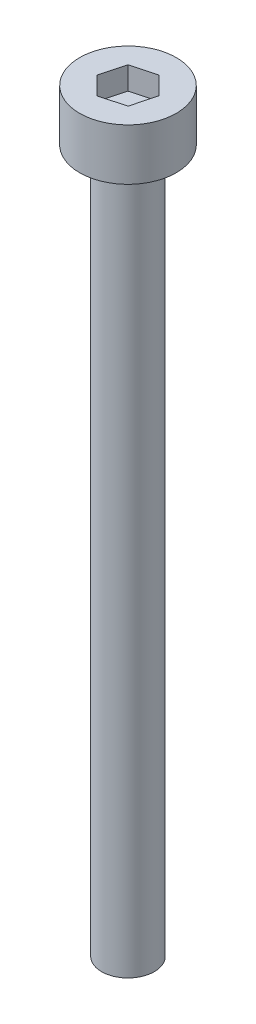
ISO-10303-21;
HEADER;
FILE_DESCRIPTION(('STEP AP214'),'2;1');
FILE_NAME('part.step','',(''),(''),'','','');
FILE_SCHEMA(('AUTOMOTIVE_DESIGN { 1 0 10303 214 1 1 1 1 }'));
ENDSEC;
DATA;
#1=APPLICATION_CONTEXT('core data for automotive mechanical design processes');
#2=APPLICATION_PROTOCOL_DEFINITION('international standard','automotive_design',2000,#1);
#3=PRODUCT_CONTEXT('',#1,'mechanical');
#4=PRODUCT('Part','Part','',(#3));
#5=PRODUCT_RELATED_PRODUCT_CATEGORY('part','',(#4));
#6=PRODUCT_DEFINITION_FORMATION('','',#4);
#7=PRODUCT_DEFINITION_CONTEXT('part definition',#1,'design');
#8=PRODUCT_DEFINITION('design','',#6,#7);
#9=PRODUCT_DEFINITION_SHAPE('','',#8);
#10=(LENGTH_UNIT() NAMED_UNIT(*) SI_UNIT(.MILLI.,.METRE.));
#11=(NAMED_UNIT(*) PLANE_ANGLE_UNIT() SI_UNIT($,.RADIAN.));
#12=(NAMED_UNIT(*) SI_UNIT($,.STERADIAN.) SOLID_ANGLE_UNIT());
#13=UNCERTAINTY_MEASURE_WITH_UNIT(LENGTH_MEASURE(1.E-05),#10,'distance_accuracy_value','');
#14=(GEOMETRIC_REPRESENTATION_CONTEXT(3) GLOBAL_UNCERTAINTY_ASSIGNED_CONTEXT((#13)) GLOBAL_UNIT_ASSIGNED_CONTEXT((#10,
#11,#12)) REPRESENTATION_CONTEXT('',''));
#15=CARTESIAN_POINT('',(0.,0.,0.));
#16=DIRECTION('',(0.,0.,1.));
#17=DIRECTION('',(1.,0.,0.));
#18=AXIS2_PLACEMENT_3D('',#15,#16,#17);
#19=CARTESIAN_POINT('',(0.,40.,0.));
#20=DIRECTION('',(0.,-1.,0.));
#21=DIRECTION('',(0.,0.,-1.));
#22=AXIS2_PLACEMENT_3D('',#19,#20,#21);
#23=CYLINDRICAL_SURFACE('',#22,1.5);
#24=CARTESIAN_POINT('',(0.,40.,0.));
#25=DIRECTION('',(0.,1.,0.));
#26=DIRECTION('',(0.,0.,1.));
#27=AXIS2_PLACEMENT_3D('',#24,#25,#26);
#28=CIRCLE('',#27,1.5);
#29=CARTESIAN_POINT('',(0.,40.,1.5));
#30=VERTEX_POINT('',#29);
#31=EDGE_CURVE('E11',#30,#30,#28,.T.);
#32=ORIENTED_EDGE('',*,*,#31,.F.);
#33=EDGE_LOOP('',(#32));
#34=FACE_BOUND('',#33,.T.);
#35=CARTESIAN_POINT('',(0.,0.,0.));
#36=DIRECTION('',(0.,1.,0.));
#37=DIRECTION('',(0.,0.,1.));
#38=AXIS2_PLACEMENT_3D('',#35,#36,#37);
#39=CIRCLE('',#38,1.5);
#40=CARTESIAN_POINT('',(0.,0.,1.5));
#41=VERTEX_POINT('',#40);
#42=EDGE_CURVE('E42',#41,#41,#39,.T.);
#43=ORIENTED_EDGE('',*,*,#42,.T.);
#44=EDGE_LOOP('',(#43));
#45=FACE_BOUND('',#44,.T.);
#46=ADVANCED_FACE('F39',(#34,#45),#23,.T.);
#47=CARTESIAN_POINT('',(0.,0.,0.));
#48=DIRECTION('',(0.,1.,0.));
#49=DIRECTION('',(0.,0.,1.));
#50=AXIS2_PLACEMENT_3D('',#47,#48,#49);
#51=PLANE('',#50);
#52=ORIENTED_EDGE('',*,*,#42,.F.);
#53=EDGE_LOOP('',(#52));
#54=FACE_BOUND('',#53,.T.);
#55=ADVANCED_FACE('F189',(#54),#51,.F.);
#56=CARTESIAN_POINT('',(0.,42.93,0.));
#57=DIRECTION('',(0.,-1.,0.));
#58=DIRECTION('',(0.,0.,-1.));
#59=AXIS2_PLACEMENT_3D('',#56,#57,#58);
#60=CYLINDRICAL_SURFACE('',#59,2.75);
#61=CARTESIAN_POINT('',(0.,42.93,0.));
#62=DIRECTION('',(0.,1.,0.));
#63=DIRECTION('',(0.,0.,1.));
#64=AXIS2_PLACEMENT_3D('',#61,#62,#63);
#65=CIRCLE('',#64,2.75);
#66=CARTESIAN_POINT('',(0.,42.93,2.75));
#67=VERTEX_POINT('',#66);
#68=EDGE_CURVE('E163',#67,#67,#65,.T.);
#69=ORIENTED_EDGE('',*,*,#68,.F.);
#70=EDGE_LOOP('',(#69));
#71=FACE_BOUND('',#70,.T.);
#72=CARTESIAN_POINT('',(0.,40.,0.));
#73=DIRECTION('',(0.,1.,0.));
#74=DIRECTION('',(0.,0.,1.));
#75=AXIS2_PLACEMENT_3D('',#72,#73,#74);
#76=CIRCLE('',#75,2.75);
#77=CARTESIAN_POINT('',(0.,40.,2.75));
#78=VERTEX_POINT('',#77);
#79=EDGE_CURVE('E153',#78,#78,#76,.T.);
#80=ORIENTED_EDGE('',*,*,#79,.T.);
#81=EDGE_LOOP('',(#80));
#82=FACE_BOUND('',#81,.T.);
#83=ADVANCED_FACE('F171',(#71,#82),#60,.T.);
#84=CARTESIAN_POINT('',(0.,42.93,0.));
#85=DIRECTION('',(0.,1.,0.));
#86=DIRECTION('',(0.,0.,1.));
#87=AXIS2_PLACEMENT_3D('',#84,#85,#86);
#88=PLANE('',#87);
#89=DIRECTION('',(0.965060636483616,0.,-0.262026654960595));
#90=VECTOR('',#89,1.);
#91=CARTESIAN_POINT('',(-0.368939204121915,42.93,1.39542724532497));
#92=LINE('',#91,#90);
#93=CARTESIAN_POINT('',(-0.368939204121915,42.93,1.39542724532497));
#94=VERTEX_POINT('',#93);
#95=CARTESIAN_POINT('',(1.0240058415234,42.93,1.01722434588407));
#96=VERTEX_POINT('',#95);
#97=EDGE_CURVE('E54',#94,#96,#92,.T.);
#98=ORIENTED_EDGE('',*,*,#97,.F.);
#99=DIRECTION('',(0.709452057906343,0.,0.704753699906893));
#100=VECTOR('',#99,1.);
#101=CARTESIAN_POINT('',(-1.39294504564532,42.93,0.378202899440891));
#102=LINE('',#101,#100);
#103=CARTESIAN_POINT('',(-1.39294504564532,42.93,0.378202899440891));
#104=VERTEX_POINT('',#103);
#105=EDGE_CURVE('E147',#104,#94,#102,.T.);
#106=ORIENTED_EDGE('',*,*,#105,.F.);
#107=DIRECTION('',(-0.255608578577273,0.,0.966780354867488));
#108=VECTOR('',#107,1.);
#109=CARTESIAN_POINT('',(-1.0240058415234,42.93,-1.01722434588407));
#110=LINE('',#109,#108);
#111=CARTESIAN_POINT('',(-1.0240058415234,42.93,-1.01722434588407));
#112=VERTEX_POINT('',#111);
#113=EDGE_CURVE('E144',#112,#104,#110,.T.);
#114=ORIENTED_EDGE('',*,*,#113,.F.);
#115=DIRECTION('',(-0.965060636483616,0.,0.262026654960595));
#116=VECTOR('',#115,1.);
#117=CARTESIAN_POINT('',(0.368939204121915,42.93,-1.39542724532496));
#118=LINE('',#117,#116);
#119=CARTESIAN_POINT('',(0.368939204121915,42.93,-1.39542724532496));
#120=VERTEX_POINT('',#119);
#121=EDGE_CURVE('E102',#120,#112,#118,.T.);
#122=ORIENTED_EDGE('',*,*,#121,.F.);
#123=DIRECTION('',(-0.709452057906343,0.,-0.704753699906893));
#124=VECTOR('',#123,1.);
#125=CARTESIAN_POINT('',(1.39294504564532,42.93,-0.378202899440891));
#126=LINE('',#125,#124);
#127=CARTESIAN_POINT('',(1.39294504564532,42.93,-0.378202899440891));
#128=VERTEX_POINT('',#127);
#129=EDGE_CURVE('E138',#128,#120,#126,.T.);
#130=ORIENTED_EDGE('',*,*,#129,.F.);
#131=DIRECTION('',(0.255608578577273,0.,-0.966780354867488));
#132=VECTOR('',#131,1.);
#133=CARTESIAN_POINT('',(1.0240058415234,42.93,1.01722434588407));
#134=LINE('',#133,#132);
#135=EDGE_CURVE('E134',#96,#128,#134,.T.);
#136=ORIENTED_EDGE('',*,*,#135,.F.);
#137=EDGE_LOOP('',(#98,#106,#114,#122,#130,#136));
#138=FACE_BOUND('',#137,.T.);
#139=ORIENTED_EDGE('',*,*,#68,.T.);
#140=EDGE_LOOP('',(#139));
#141=FACE_BOUND('',#140,.T.);
#142=ADVANCED_FACE('F176',(#138,#141),#88,.T.);
#143=CARTESIAN_POINT('',(0.,40.,0.));
#144=DIRECTION('',(0.,1.,0.));
#145=DIRECTION('',(0.,0.,1.));
#146=AXIS2_PLACEMENT_3D('',#143,#144,#145);
#147=PLANE('',#146);
#148=ORIENTED_EDGE('',*,*,#31,.T.);
#149=EDGE_LOOP('',(#148));
#150=FACE_BOUND('',#149,.T.);
#151=ORIENTED_EDGE('',*,*,#79,.F.);
#152=EDGE_LOOP('',(#151));
#153=FACE_BOUND('',#152,.T.);
#154=ADVANCED_FACE('F173',(#150,#153),#147,.F.);
#155=CARTESIAN_POINT('',(-0.368939204121915,41.63,1.39542724532497));
#156=DIRECTION('',(0.262026654960595,0.,0.965060636483616));
#157=DIRECTION('',(0.965060636483616,0.,-0.262026654960595));
#158=AXIS2_PLACEMENT_3D('',#155,#156,#157);
#159=PLANE('',#158);
#160=ORIENTED_EDGE('',*,*,#97,.T.);
#161=DIRECTION('',(0.,1.,0.));
#162=VECTOR('',#161,1.);
#163=CARTESIAN_POINT('',(1.0240058415234,41.63,1.01722434588407));
#164=LINE('',#163,#162);
#165=CARTESIAN_POINT('',(1.0240058415234,41.63,1.01722434588407));
#166=VERTEX_POINT('',#165);
#167=EDGE_CURVE('E84',#166,#96,#164,.T.);
#168=ORIENTED_EDGE('',*,*,#167,.F.);
#169=DIRECTION('',(0.965060636483616,0.,-0.262026654960595));
#170=VECTOR('',#169,1.);
#171=CARTESIAN_POINT('',(-0.368939204121915,41.63,1.39542724532497));
#172=LINE('',#171,#170);
#173=CARTESIAN_POINT('',(-0.368939204121915,41.63,1.39542724532497));
#174=VERTEX_POINT('',#173);
#175=EDGE_CURVE('E150',#174,#166,#172,.T.);
#176=ORIENTED_EDGE('',*,*,#175,.F.);
#177=DIRECTION('',(0.,1.,0.));
#178=VECTOR('',#177,1.);
#179=CARTESIAN_POINT('',(-0.368939204121915,41.63,1.39542724532497));
#180=LINE('',#179,#178);
#181=EDGE_CURVE('E62',#174,#94,#180,.T.);
#182=ORIENTED_EDGE('',*,*,#181,.T.);
#183=EDGE_LOOP('',(#160,#168,#176,#182));
#184=FACE_BOUND('',#183,.T.);
#185=ADVANCED_FACE('F175',(#184),#159,.F.);
#186=CARTESIAN_POINT('',(-1.39294504564532,41.63,0.378202899440891));
#187=DIRECTION('',(-0.704753699906893,0.,0.709452057906343));
#188=DIRECTION('',(0.709452057906343,0.,0.704753699906893));
#189=AXIS2_PLACEMENT_3D('',#186,#187,#188);
#190=PLANE('',#189);
#191=ORIENTED_EDGE('',*,*,#105,.T.);
#192=ORIENTED_EDGE('',*,*,#181,.F.);
#193=DIRECTION('',(0.709452057906343,0.,0.704753699906893));
#194=VECTOR('',#193,1.);
#195=CARTESIAN_POINT('',(-1.39294504564532,41.63,0.378202899440891));
#196=LINE('',#195,#194);
#197=CARTESIAN_POINT('',(-1.39294504564532,41.63,0.378202899440891));
#198=VERTEX_POINT('',#197);
#199=EDGE_CURVE('E116',#198,#174,#196,.T.);
#200=ORIENTED_EDGE('',*,*,#199,.F.);
#201=DIRECTION('',(0.,1.,0.));
#202=VECTOR('',#201,1.);
#203=CARTESIAN_POINT('',(-1.39294504564532,41.63,0.378202899440891));
#204=LINE('',#203,#202);
#205=EDGE_CURVE('E107',#198,#104,#204,.T.);
#206=ORIENTED_EDGE('',*,*,#205,.T.);
#207=EDGE_LOOP('',(#191,#192,#200,#206));
#208=FACE_BOUND('',#207,.T.);
#209=ADVANCED_FACE('F183',(#208),#190,.F.);
#210=CARTESIAN_POINT('',(-1.0240058415234,41.63,-1.01722434588407));
#211=DIRECTION('',(-0.966780354867488,0.,-0.255608578577273));
#212=DIRECTION('',(-0.255608578577273,0.,0.966780354867488));
#213=AXIS2_PLACEMENT_3D('',#210,#211,#212);
#214=PLANE('',#213);
#215=ORIENTED_EDGE('',*,*,#113,.T.);
#216=ORIENTED_EDGE('',*,*,#205,.F.);
#217=DIRECTION('',(-0.255608578577273,0.,0.966780354867488));
#218=VECTOR('',#217,1.);
#219=CARTESIAN_POINT('',(-1.0240058415234,41.63,-1.01722434588407));
#220=LINE('',#219,#218);
#221=CARTESIAN_POINT('',(-1.0240058415234,41.63,-1.01722434588407));
#222=VERTEX_POINT('',#221);
#223=EDGE_CURVE('E111',#222,#198,#220,.T.);
#224=ORIENTED_EDGE('',*,*,#223,.F.);
#225=DIRECTION('',(0.,1.,0.));
#226=VECTOR('',#225,1.);
#227=CARTESIAN_POINT('',(-1.0240058415234,41.63,-1.01722434588407));
#228=LINE('',#227,#226);
#229=EDGE_CURVE('E95',#222,#112,#228,.T.);
#230=ORIENTED_EDGE('',*,*,#229,.T.);
#231=EDGE_LOOP('',(#215,#216,#224,#230));
#232=FACE_BOUND('',#231,.T.);
#233=ADVANCED_FACE('F112',(#232),#214,.F.);
#234=CARTESIAN_POINT('',(0.368939204121915,41.63,-1.39542724532496));
#235=DIRECTION('',(-0.262026654960595,0.,-0.965060636483616));
#236=DIRECTION('',(-0.965060636483616,0.,0.262026654960595));
#237=AXIS2_PLACEMENT_3D('',#234,#235,#236);
#238=PLANE('',#237);
#239=ORIENTED_EDGE('',*,*,#121,.T.);
#240=ORIENTED_EDGE('',*,*,#229,.F.);
#241=DIRECTION('',(-0.965060636483616,0.,0.262026654960595));
#242=VECTOR('',#241,1.);
#243=CARTESIAN_POINT('',(0.368939204121915,41.63,-1.39542724532496));
#244=LINE('',#243,#242);
#245=CARTESIAN_POINT('',(0.368939204121915,41.63,-1.39542724532496));
#246=VERTEX_POINT('',#245);
#247=EDGE_CURVE('E99',#246,#222,#244,.T.);
#248=ORIENTED_EDGE('',*,*,#247,.F.);
#249=DIRECTION('',(0.,1.,0.));
#250=VECTOR('',#249,1.);
#251=CARTESIAN_POINT('',(0.368939204121915,41.63,-1.39542724532496));
#252=LINE('',#251,#250);
#253=EDGE_CURVE('E108',#246,#120,#252,.T.);
#254=ORIENTED_EDGE('',*,*,#253,.T.);
#255=EDGE_LOOP('',(#239,#240,#248,#254));
#256=FACE_BOUND('',#255,.T.);
#257=ADVANCED_FACE('F97',(#256),#238,.F.);
#258=CARTESIAN_POINT('',(1.39294504564532,41.63,-0.378202899440891));
#259=DIRECTION('',(0.704753699906893,0.,-0.709452057906343));
#260=DIRECTION('',(-0.709452057906343,0.,-0.704753699906893));
#261=AXIS2_PLACEMENT_3D('',#258,#259,#260);
#262=PLANE('',#261);
#263=ORIENTED_EDGE('',*,*,#129,.T.);
#264=ORIENTED_EDGE('',*,*,#253,.F.);
#265=DIRECTION('',(-0.709452057906343,0.,-0.704753699906893));
#266=VECTOR('',#265,1.);
#267=CARTESIAN_POINT('',(1.39294504564532,41.63,-0.378202899440891));
#268=LINE('',#267,#266);
#269=CARTESIAN_POINT('',(1.39294504564532,41.63,-0.378202899440891));
#270=VERTEX_POINT('',#269);
#271=EDGE_CURVE('E122',#270,#246,#268,.T.);
#272=ORIENTED_EDGE('',*,*,#271,.F.);
#273=DIRECTION('',(0.,1.,0.));
#274=VECTOR('',#273,1.);
#275=CARTESIAN_POINT('',(1.39294504564532,41.63,-0.378202899440891));
#276=LINE('',#275,#274);
#277=EDGE_CURVE('E158',#270,#128,#276,.T.);
#278=ORIENTED_EDGE('',*,*,#277,.T.);
#279=EDGE_LOOP('',(#263,#264,#272,#278));
#280=FACE_BOUND('',#279,.T.);
#281=ADVANCED_FACE('F245',(#280),#262,.F.);
#282=CARTESIAN_POINT('',(1.0240058415234,41.63,1.01722434588407));
#283=DIRECTION('',(0.966780354867488,0.,0.255608578577273));
#284=DIRECTION('',(0.255608578577273,0.,-0.966780354867488));
#285=AXIS2_PLACEMENT_3D('',#282,#283,#284);
#286=PLANE('',#285);
#287=ORIENTED_EDGE('',*,*,#135,.T.);
#288=ORIENTED_EDGE('',*,*,#277,.F.);
#289=DIRECTION('',(0.255608578577273,0.,-0.966780354867488));
#290=VECTOR('',#289,1.);
#291=CARTESIAN_POINT('',(1.0240058415234,41.63,1.01722434588407));
#292=LINE('',#291,#290);
#293=EDGE_CURVE('E126',#166,#270,#292,.T.);
#294=ORIENTED_EDGE('',*,*,#293,.F.);
#295=ORIENTED_EDGE('',*,*,#167,.T.);
#296=EDGE_LOOP('',(#287,#288,#294,#295));
#297=FACE_BOUND('',#296,.T.);
#298=ADVANCED_FACE('F254',(#297),#286,.F.);
#299=CARTESIAN_POINT('',(0.,41.63,0.));
#300=DIRECTION('',(0.,1.,0.));
#301=DIRECTION('',(0.,0.,1.));
#302=AXIS2_PLACEMENT_3D('',#299,#300,#301);
#303=PLANE('',#302);
#304=ORIENTED_EDGE('',*,*,#175,.T.);
#305=ORIENTED_EDGE('',*,*,#293,.T.);
#306=ORIENTED_EDGE('',*,*,#271,.T.);
#307=ORIENTED_EDGE('',*,*,#247,.T.);
#308=ORIENTED_EDGE('',*,*,#223,.T.);
#309=ORIENTED_EDGE('',*,*,#199,.T.);
#310=EDGE_LOOP('',(#304,#305,#306,#307,#308,#309));
#311=FACE_BOUND('',#310,.T.);
#312=ADVANCED_FACE('F119',(#311),#303,.T.);
#313=CLOSED_SHELL('',(#46,#55,#83,#142,#154,#185,#209,#233,#257,#281,#298,#312));
#314=MANIFOLD_SOLID_BREP('B2',#313);
#315=ADVANCED_BREP_SHAPE_REPRESENTATION('',(#18,#314),#14);
#316=SHAPE_DEFINITION_REPRESENTATION(#9,#315);
ENDSEC;
END-ISO-10303-21;
